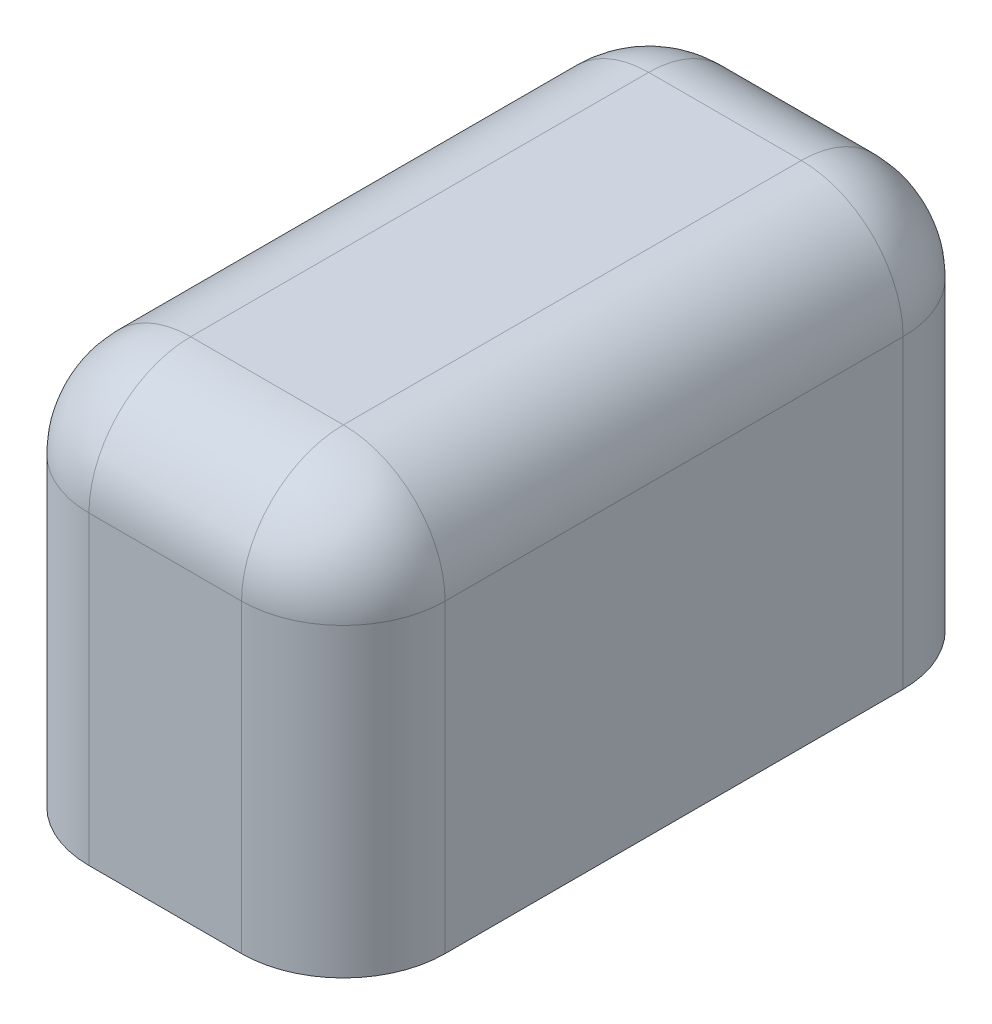
ISO-10303-21;
HEADER;
FILE_DESCRIPTION(('STEP AP214'),'2;1');
FILE_NAME('part.step','',(''),(''),'','','');
FILE_SCHEMA(('AUTOMOTIVE_DESIGN { 1 0 10303 214 1 1 1 1 }'));
ENDSEC;
DATA;
#1=APPLICATION_CONTEXT('core data for automotive mechanical design processes');
#2=APPLICATION_PROTOCOL_DEFINITION('international standard','automotive_design',2000,#1);
#3=PRODUCT_CONTEXT('',#1,'mechanical');
#4=PRODUCT('Part','Part','',(#3));
#5=PRODUCT_RELATED_PRODUCT_CATEGORY('part','',(#4));
#6=PRODUCT_DEFINITION_FORMATION('','',#4);
#7=PRODUCT_DEFINITION_CONTEXT('part definition',#1,'design');
#8=PRODUCT_DEFINITION('design','',#6,#7);
#9=PRODUCT_DEFINITION_SHAPE('','',#8);
#10=(LENGTH_UNIT() NAMED_UNIT(*) SI_UNIT(.MILLI.,.METRE.));
#11=(NAMED_UNIT(*) PLANE_ANGLE_UNIT() SI_UNIT($,.RADIAN.));
#12=(NAMED_UNIT(*) SI_UNIT($,.STERADIAN.) SOLID_ANGLE_UNIT());
#13=UNCERTAINTY_MEASURE_WITH_UNIT(LENGTH_MEASURE(1.E-05),#10,'distance_accuracy_value','');
#14=(GEOMETRIC_REPRESENTATION_CONTEXT(3) GLOBAL_UNCERTAINTY_ASSIGNED_CONTEXT((#13)) GLOBAL_UNIT_ASSIGNED_CONTEXT((#10,
#11,#12)) REPRESENTATION_CONTEXT('',''));
#15=CARTESIAN_POINT('',(0.,0.,0.));
#16=DIRECTION('',(0.,0.,1.));
#17=DIRECTION('',(1.,0.,0.));
#18=AXIS2_PLACEMENT_3D('',#15,#16,#17);
#19=CARTESIAN_POINT('',(4.445,0.,0.));
#20=DIRECTION('',(0.,0.,1.));
#21=DIRECTION('',(-1.,0.,0.));
#22=AXIS2_PLACEMENT_3D('',#19,#20,#21);
#23=PLANE('',#22);
#24=DIRECTION('',(-1.,0.,0.));
#25=VECTOR('',#24,1.);
#26=CARTESIAN_POINT('',(4.445,7.62,0.));
#27=LINE('',#26,#25);
#28=CARTESIAN_POINT('',(1.905,7.62,0.));
#29=VERTEX_POINT('',#28);
#30=CARTESIAN_POINT('',(-1.905,7.62,0.));
#31=VERTEX_POINT('',#30);
#32=EDGE_CURVE('E177',#29,#31,#27,.T.);
#33=ORIENTED_EDGE('',*,*,#32,.F.);
#34=DIRECTION('',(0.,-1.,0.));
#35=VECTOR('',#34,1.);
#36=CARTESIAN_POINT('',(1.905,0.,0.));
#37=LINE('',#36,#35);
#38=CARTESIAN_POINT('',(1.905,0.,0.));
#39=VERTEX_POINT('',#38);
#40=EDGE_CURVE('E175',#39,#29,#37,.F.);
#41=ORIENTED_EDGE('',*,*,#40,.F.);
#42=DIRECTION('',(-1.,0.,0.));
#43=VECTOR('',#42,1.);
#44=CARTESIAN_POINT('',(4.445,0.,0.));
#45=LINE('',#44,#43);
#46=CARTESIAN_POINT('',(-1.905,0.,0.));
#47=VERTEX_POINT('',#46);
#48=EDGE_CURVE('E150',#39,#47,#45,.T.);
#49=ORIENTED_EDGE('',*,*,#48,.T.);
#50=DIRECTION('',(0.,-1.,0.));
#51=VECTOR('',#50,1.);
#52=CARTESIAN_POINT('',(-1.905,0.,0.));
#53=LINE('',#52,#51);
#54=EDGE_CURVE('E179',#31,#47,#53,.T.);
#55=ORIENTED_EDGE('',*,*,#54,.F.);
#56=EDGE_LOOP('',(#33,#41,#49,#55));
#57=FACE_BOUND('',#56,.T.);
#58=ADVANCED_FACE('F41',(#57),#23,.F.);
#59=CARTESIAN_POINT('',(4.445,0.,0.));
#60=DIRECTION('',(0.,1.,0.));
#61=DIRECTION('',(0.,0.,-1.));
#62=AXIS2_PLACEMENT_3D('',#59,#60,#61);
#63=PLANE('',#62);
#64=DIRECTION('',(-1.,0.,0.));
#65=VECTOR('',#64,1.);
#66=CARTESIAN_POINT('',(4.445,0.,16.51));
#67=LINE('',#66,#65);
#68=CARTESIAN_POINT('',(1.905,0.,16.51));
#69=VERTEX_POINT('',#68);
#70=CARTESIAN_POINT('',(-1.905,0.,16.51));
#71=VERTEX_POINT('',#70);
#72=EDGE_CURVE('E153',#69,#71,#67,.T.);
#73=ORIENTED_EDGE('',*,*,#72,.T.);
#74=CARTESIAN_POINT('',(-1.905,0.,13.97));
#75=DIRECTION('',(0.,-1.,0.));
#76=DIRECTION('',(0.,0.,-1.));
#77=AXIS2_PLACEMENT_3D('',#74,#75,#76);
#78=CIRCLE('',#77,2.54);
#79=CARTESIAN_POINT('',(-4.445,0.,13.97));
#80=VERTEX_POINT('',#79);
#81=EDGE_CURVE('E50',#80,#71,#78,.F.);
#82=ORIENTED_EDGE('',*,*,#81,.F.);
#83=DIRECTION('',(0.,0.,1.));
#84=VECTOR('',#83,1.);
#85=CARTESIAN_POINT('',(-4.445,0.,0.));
#86=LINE('',#85,#84);
#87=CARTESIAN_POINT('',(-4.445,0.,2.54));
#88=VERTEX_POINT('',#87);
#89=EDGE_CURVE('E229',#88,#80,#86,.T.);
#90=ORIENTED_EDGE('',*,*,#89,.F.);
#91=CARTESIAN_POINT('',(-1.905,0.,2.54));
#92=DIRECTION('',(0.,-1.,0.));
#93=DIRECTION('',(0.,0.,-1.));
#94=AXIS2_PLACEMENT_3D('',#91,#92,#93);
#95=CIRCLE('',#94,2.54);
#96=EDGE_CURVE('E190',#47,#88,#95,.F.);
#97=ORIENTED_EDGE('',*,*,#96,.F.);
#98=ORIENTED_EDGE('',*,*,#48,.F.);
#99=CARTESIAN_POINT('',(1.905,0.,2.54));
#100=DIRECTION('',(0.,-1.,0.));
#101=DIRECTION('',(0.,0.,-1.));
#102=AXIS2_PLACEMENT_3D('',#99,#100,#101);
#103=CIRCLE('',#102,2.54);
#104=CARTESIAN_POINT('',(4.445,0.,2.54));
#105=VERTEX_POINT('',#104);
#106=EDGE_CURVE('E188',#105,#39,#103,.F.);
#107=ORIENTED_EDGE('',*,*,#106,.F.);
#108=DIRECTION('',(0.,0.,1.));
#109=VECTOR('',#108,1.);
#110=CARTESIAN_POINT('',(4.445,0.,0.));
#111=LINE('',#110,#109);
#112=CARTESIAN_POINT('',(4.445,0.,13.97));
#113=VERTEX_POINT('',#112);
#114=EDGE_CURVE('E232',#105,#113,#111,.T.);
#115=ORIENTED_EDGE('',*,*,#114,.T.);
#116=CARTESIAN_POINT('',(1.905,0.,13.97));
#117=DIRECTION('',(0.,-1.,0.));
#118=DIRECTION('',(0.,0.,-1.));
#119=AXIS2_PLACEMENT_3D('',#116,#117,#118);
#120=CIRCLE('',#119,2.54);
#121=EDGE_CURVE('E11',#69,#113,#120,.F.);
#122=ORIENTED_EDGE('',*,*,#121,.F.);
#123=EDGE_LOOP('',(#73,#82,#90,#97,#98,#107,#115,#122));
#124=FACE_BOUND('',#123,.T.);
#125=ADVANCED_FACE('F224',(#124),#63,.F.);
#126=CARTESIAN_POINT('',(4.445,0.,16.51));
#127=DIRECTION('',(0.,0.,-1.));
#128=DIRECTION('',(1.,0.,0.));
#129=AXIS2_PLACEMENT_3D('',#126,#127,#128);
#130=PLANE('',#129);
#131=DIRECTION('',(-1.,0.,0.));
#132=VECTOR('',#131,1.);
#133=CARTESIAN_POINT('',(4.445,7.62,16.51));
#134=LINE('',#133,#132);
#135=CARTESIAN_POINT('',(-1.905,7.62,16.51));
#136=VERTEX_POINT('',#135);
#137=CARTESIAN_POINT('',(1.905,7.62,16.51));
#138=VERTEX_POINT('',#137);
#139=EDGE_CURVE('E162',#136,#138,#134,.F.);
#140=ORIENTED_EDGE('',*,*,#139,.F.);
#141=DIRECTION('',(0.,1.,0.));
#142=VECTOR('',#141,1.);
#143=CARTESIAN_POINT('',(-1.905,10.16,16.51));
#144=LINE('',#143,#142);
#145=EDGE_CURVE('E159',#71,#136,#144,.T.);
#146=ORIENTED_EDGE('',*,*,#145,.F.);
#147=ORIENTED_EDGE('',*,*,#72,.F.);
#148=DIRECTION('',(0.,1.,0.));
#149=VECTOR('',#148,1.);
#150=CARTESIAN_POINT('',(1.905,0.,16.51));
#151=LINE('',#150,#149);
#152=EDGE_CURVE('E165',#138,#69,#151,.F.);
#153=ORIENTED_EDGE('',*,*,#152,.F.);
#154=EDGE_LOOP('',(#140,#146,#147,#153));
#155=FACE_BOUND('',#154,.T.);
#156=ADVANCED_FACE('F240',(#155),#130,.F.);
#157=CARTESIAN_POINT('',(4.445,10.16,0.));
#158=DIRECTION('',(0.,-1.,0.));
#159=DIRECTION('',(0.,0.,1.));
#160=AXIS2_PLACEMENT_3D('',#157,#158,#159);
#161=PLANE('',#160);
#162=DIRECTION('',(0.,0.,-1.));
#163=VECTOR('',#162,1.);
#164=CARTESIAN_POINT('',(1.905,10.16,0.));
#165=LINE('',#164,#163);
#166=CARTESIAN_POINT('',(1.905,10.16,2.54));
#167=VERTEX_POINT('',#166);
#168=CARTESIAN_POINT('',(1.905,10.16,13.97));
#169=VERTEX_POINT('',#168);
#170=EDGE_CURVE('E122',#167,#169,#165,.F.);
#171=ORIENTED_EDGE('',*,*,#170,.F.);
#172=DIRECTION('',(-1.,0.,0.));
#173=VECTOR('',#172,1.);
#174=CARTESIAN_POINT('',(4.445,10.16,2.54));
#175=LINE('',#174,#173);
#176=CARTESIAN_POINT('',(-1.905,10.16,2.54));
#177=VERTEX_POINT('',#176);
#178=EDGE_CURVE('E138',#177,#167,#175,.F.);
#179=ORIENTED_EDGE('',*,*,#178,.F.);
#180=DIRECTION('',(0.,0.,-1.));
#181=VECTOR('',#180,1.);
#182=CARTESIAN_POINT('',(-1.905,10.16,0.));
#183=LINE('',#182,#181);
#184=CARTESIAN_POINT('',(-1.905,10.16,13.97));
#185=VERTEX_POINT('',#184);
#186=EDGE_CURVE('E144',#185,#177,#183,.T.);
#187=ORIENTED_EDGE('',*,*,#186,.F.);
#188=DIRECTION('',(-1.,0.,0.));
#189=VECTOR('',#188,1.);
#190=CARTESIAN_POINT('',(4.445,10.16,13.97));
#191=LINE('',#190,#189);
#192=EDGE_CURVE('E149',#169,#185,#191,.T.);
#193=ORIENTED_EDGE('',*,*,#192,.F.);
#194=EDGE_LOOP('',(#171,#179,#187,#193));
#195=FACE_BOUND('',#194,.T.);
#196=ADVANCED_FACE('F147',(#195),#161,.F.);
#197=CARTESIAN_POINT('',(4.445,0.,0.));
#198=DIRECTION('',(-1.,0.,0.));
#199=DIRECTION('',(0.,0.,-1.));
#200=AXIS2_PLACEMENT_3D('',#197,#198,#199);
#201=PLANE('',#200);
#202=ORIENTED_EDGE('',*,*,#114,.F.);
#203=DIRECTION('',(0.,-1.,0.));
#204=VECTOR('',#203,1.);
#205=CARTESIAN_POINT('',(4.445,0.,2.54));
#206=LINE('',#205,#204);
#207=CARTESIAN_POINT('',(4.445,7.62,2.54));
#208=VERTEX_POINT('',#207);
#209=EDGE_CURVE('E182',#208,#105,#206,.T.);
#210=ORIENTED_EDGE('',*,*,#209,.F.);
#211=DIRECTION('',(0.,0.,-1.));
#212=VECTOR('',#211,1.);
#213=CARTESIAN_POINT('',(4.445,7.62,0.));
#214=LINE('',#213,#212);
#215=CARTESIAN_POINT('',(4.445,7.62,13.97));
#216=VERTEX_POINT('',#215);
#217=EDGE_CURVE('E124',#216,#208,#214,.T.);
#218=ORIENTED_EDGE('',*,*,#217,.F.);
#219=DIRECTION('',(0.,1.,0.));
#220=VECTOR('',#219,1.);
#221=CARTESIAN_POINT('',(4.445,0.,13.97));
#222=LINE('',#221,#220);
#223=EDGE_CURVE('E185',#113,#216,#222,.T.);
#224=ORIENTED_EDGE('',*,*,#223,.F.);
#225=EDGE_LOOP('',(#202,#210,#218,#224));
#226=FACE_BOUND('',#225,.T.);
#227=ADVANCED_FACE('F257',(#226),#201,.F.);
#228=CARTESIAN_POINT('',(-4.445,0.,0.));
#229=DIRECTION('',(-1.,0.,0.));
#230=DIRECTION('',(0.,0.,-1.));
#231=AXIS2_PLACEMENT_3D('',#228,#229,#230);
#232=PLANE('',#231);
#233=DIRECTION('',(0.,0.,-1.));
#234=VECTOR('',#233,1.);
#235=CARTESIAN_POINT('',(-4.445,7.62,16.51));
#236=LINE('',#235,#234);
#237=CARTESIAN_POINT('',(-4.445,7.62,2.54));
#238=VERTEX_POINT('',#237);
#239=CARTESIAN_POINT('',(-4.445,7.62,13.97));
#240=VERTEX_POINT('',#239);
#241=EDGE_CURVE('E170',#238,#240,#236,.F.);
#242=ORIENTED_EDGE('',*,*,#241,.F.);
#243=DIRECTION('',(0.,-1.,0.));
#244=VECTOR('',#243,1.);
#245=CARTESIAN_POINT('',(-4.445,10.16,2.54));
#246=LINE('',#245,#244);
#247=EDGE_CURVE('E167',#88,#238,#246,.F.);
#248=ORIENTED_EDGE('',*,*,#247,.F.);
#249=ORIENTED_EDGE('',*,*,#89,.T.);
#250=DIRECTION('',(0.,1.,0.));
#251=VECTOR('',#250,1.);
#252=CARTESIAN_POINT('',(-4.445,0.,13.97));
#253=LINE('',#252,#251);
#254=EDGE_CURVE('E173',#240,#80,#253,.F.);
#255=ORIENTED_EDGE('',*,*,#254,.F.);
#256=EDGE_LOOP('',(#242,#248,#249,#255));
#257=FACE_BOUND('',#256,.T.);
#258=ADVANCED_FACE('F245',(#257),#232,.T.);
#259=CARTESIAN_POINT('',(1.905,0.,2.54));
#260=DIRECTION('',(0.,-1.,0.));
#261=DIRECTION('',(0.,0.,1.));
#262=AXIS2_PLACEMENT_3D('',#259,#260,#261);
#263=CYLINDRICAL_SURFACE('',#262,2.54);
#264=ORIENTED_EDGE('',*,*,#106,.T.);
#265=ORIENTED_EDGE('',*,*,#40,.T.);
#266=CARTESIAN_POINT('',(1.905,7.62,2.54));
#267=DIRECTION('',(0.,-1.,0.));
#268=DIRECTION('',(0.,0.,-1.));
#269=AXIS2_PLACEMENT_3D('',#266,#267,#268);
#270=CIRCLE('',#269,2.54);
#271=EDGE_CURVE('E45',#29,#208,#270,.T.);
#272=ORIENTED_EDGE('',*,*,#271,.T.);
#273=ORIENTED_EDGE('',*,*,#209,.T.);
#274=EDGE_LOOP('',(#264,#265,#272,#273));
#275=FACE_BOUND('',#274,.T.);
#276=ADVANCED_FACE('F43',(#275),#263,.T.);
#277=CARTESIAN_POINT('',(4.445,7.62,2.54));
#278=DIRECTION('',(-1.,0.,0.));
#279=DIRECTION('',(0.,0.,-1.));
#280=AXIS2_PLACEMENT_3D('',#277,#278,#279);
#281=CYLINDRICAL_SURFACE('',#280,2.54);
#282=CARTESIAN_POINT('',(-1.905,7.62,2.54));
#283=DIRECTION('',(1.,0.,0.));
#284=DIRECTION('',(0.,0.,-1.));
#285=AXIS2_PLACEMENT_3D('',#282,#283,#284);
#286=CIRCLE('',#285,2.54);
#287=EDGE_CURVE('E135',#31,#177,#286,.T.);
#288=ORIENTED_EDGE('',*,*,#287,.T.);
#289=ORIENTED_EDGE('',*,*,#178,.T.);
#290=CARTESIAN_POINT('',(1.905,7.62,2.54));
#291=DIRECTION('',(-1.,0.,0.));
#292=DIRECTION('',(0.,0.,1.));
#293=AXIS2_PLACEMENT_3D('',#290,#291,#292);
#294=CIRCLE('',#293,2.54);
#295=EDGE_CURVE('E129',#167,#29,#294,.T.);
#296=ORIENTED_EDGE('',*,*,#295,.T.);
#297=ORIENTED_EDGE('',*,*,#32,.T.);
#298=EDGE_LOOP('',(#288,#289,#296,#297));
#299=FACE_BOUND('',#298,.T.);
#300=ADVANCED_FACE('F139',(#299),#281,.T.);
#301=CARTESIAN_POINT('',(-1.905,0.,2.54));
#302=DIRECTION('',(0.,1.,0.));
#303=DIRECTION('',(0.,0.,-1.));
#304=AXIS2_PLACEMENT_3D('',#301,#302,#303);
#305=CYLINDRICAL_SURFACE('',#304,2.54);
#306=ORIENTED_EDGE('',*,*,#96,.T.);
#307=ORIENTED_EDGE('',*,*,#247,.T.);
#308=CARTESIAN_POINT('',(-1.905,7.62,2.54));
#309=DIRECTION('',(0.,-1.,0.));
#310=DIRECTION('',(0.,0.,-1.));
#311=AXIS2_PLACEMENT_3D('',#308,#309,#310);
#312=CIRCLE('',#311,2.54);
#313=EDGE_CURVE('E126',#238,#31,#312,.T.);
#314=ORIENTED_EDGE('',*,*,#313,.T.);
#315=ORIENTED_EDGE('',*,*,#54,.T.);
#316=EDGE_LOOP('',(#306,#307,#314,#315));
#317=FACE_BOUND('',#316,.T.);
#318=ADVANCED_FACE('F212',(#317),#305,.T.);
#319=CARTESIAN_POINT('',(1.905,7.62,2.54));
#320=DIRECTION('',(0.,0.,-1.));
#321=DIRECTION('',(1.,0.,0.));
#322=AXIS2_PLACEMENT_3D('',#319,#320,#321);
#323=SPHERICAL_SURFACE('',#322,2.54);
#324=ORIENTED_EDGE('',*,*,#295,.F.);
#325=CARTESIAN_POINT('',(1.905,7.62,2.54));
#326=DIRECTION('',(0.,0.,1.));
#327=DIRECTION('',(1.,0.,0.));
#328=AXIS2_PLACEMENT_3D('',#325,#326,#327);
#329=CIRCLE('',#328,2.54);
#330=EDGE_CURVE('E66',#167,#208,#329,.F.);
#331=ORIENTED_EDGE('',*,*,#330,.T.);
#332=ORIENTED_EDGE('',*,*,#271,.F.);
#333=EDGE_LOOP('',(#324,#331,#332));
#334=FACE_BOUND('',#333,.T.);
#335=ADVANCED_FACE('F131',(#334),#323,.T.);
#336=CARTESIAN_POINT('',(-1.905,7.62,2.54));
#337=DIRECTION('',(0.,0.,-1.));
#338=DIRECTION('',(1.,0.,0.));
#339=AXIS2_PLACEMENT_3D('',#336,#337,#338);
#340=SPHERICAL_SURFACE('',#339,2.54);
#341=ORIENTED_EDGE('',*,*,#313,.F.);
#342=CARTESIAN_POINT('',(-1.905,7.62,2.54));
#343=DIRECTION('',(0.,0.,1.));
#344=DIRECTION('',(1.,0.,0.));
#345=AXIS2_PLACEMENT_3D('',#342,#343,#344);
#346=CIRCLE('',#345,2.54);
#347=EDGE_CURVE('E127',#238,#177,#346,.F.);
#348=ORIENTED_EDGE('',*,*,#347,.T.);
#349=ORIENTED_EDGE('',*,*,#287,.F.);
#350=EDGE_LOOP('',(#341,#348,#349));
#351=FACE_BOUND('',#350,.T.);
#352=ADVANCED_FACE('F216',(#351),#340,.T.);
#353=CARTESIAN_POINT('',(1.905,0.,13.97));
#354=DIRECTION('',(0.,1.,0.));
#355=DIRECTION('',(0.,0.,-1.));
#356=AXIS2_PLACEMENT_3D('',#353,#354,#355);
#357=CYLINDRICAL_SURFACE('',#356,2.54);
#358=ORIENTED_EDGE('',*,*,#121,.T.);
#359=ORIENTED_EDGE('',*,*,#223,.T.);
#360=CARTESIAN_POINT('',(1.905,7.62,13.97));
#361=DIRECTION('',(0.,-1.,0.));
#362=DIRECTION('',(0.,0.,-1.));
#363=AXIS2_PLACEMENT_3D('',#360,#361,#362);
#364=CIRCLE('',#363,2.54);
#365=EDGE_CURVE('E205',#216,#138,#364,.T.);
#366=ORIENTED_EDGE('',*,*,#365,.T.);
#367=ORIENTED_EDGE('',*,*,#152,.T.);
#368=EDGE_LOOP('',(#358,#359,#366,#367));
#369=FACE_BOUND('',#368,.T.);
#370=ADVANCED_FACE('F254',(#369),#357,.T.);
#371=CARTESIAN_POINT('',(1.905,7.62,0.));
#372=DIRECTION('',(0.,0.,-1.));
#373=DIRECTION('',(1.,0.,0.));
#374=AXIS2_PLACEMENT_3D('',#371,#372,#373);
#375=CYLINDRICAL_SURFACE('',#374,2.54);
#376=ORIENTED_EDGE('',*,*,#330,.F.);
#377=ORIENTED_EDGE('',*,*,#170,.T.);
#378=CARTESIAN_POINT('',(1.905,7.62,13.97));
#379=DIRECTION('',(0.,0.,-1.));
#380=DIRECTION('',(-1.,0.,0.));
#381=AXIS2_PLACEMENT_3D('',#378,#379,#380);
#382=CIRCLE('',#381,2.54);
#383=EDGE_CURVE('E58',#169,#216,#382,.T.);
#384=ORIENTED_EDGE('',*,*,#383,.T.);
#385=ORIENTED_EDGE('',*,*,#217,.T.);
#386=EDGE_LOOP('',(#376,#377,#384,#385));
#387=FACE_BOUND('',#386,.T.);
#388=ADVANCED_FACE('F120',(#387),#375,.T.);
#389=CARTESIAN_POINT('',(-1.905,7.62,0.));
#390=DIRECTION('',(0.,0.,1.));
#391=DIRECTION('',(-1.,0.,0.));
#392=AXIS2_PLACEMENT_3D('',#389,#390,#391);
#393=CYLINDRICAL_SURFACE('',#392,2.54);
#394=ORIENTED_EDGE('',*,*,#347,.F.);
#395=ORIENTED_EDGE('',*,*,#241,.T.);
#396=CARTESIAN_POINT('',(-1.905,7.62,13.97));
#397=DIRECTION('',(0.,0.,-1.));
#398=DIRECTION('',(-1.,0.,0.));
#399=AXIS2_PLACEMENT_3D('',#396,#397,#398);
#400=CIRCLE('',#399,2.54);
#401=EDGE_CURVE('E201',#240,#185,#400,.T.);
#402=ORIENTED_EDGE('',*,*,#401,.T.);
#403=ORIENTED_EDGE('',*,*,#186,.T.);
#404=EDGE_LOOP('',(#394,#395,#402,#403));
#405=FACE_BOUND('',#404,.T.);
#406=ADVANCED_FACE('F247',(#405),#393,.T.);
#407=CARTESIAN_POINT('',(-1.905,0.,13.97));
#408=DIRECTION('',(0.,-1.,0.));
#409=DIRECTION('',(0.,0.,1.));
#410=AXIS2_PLACEMENT_3D('',#407,#408,#409);
#411=CYLINDRICAL_SURFACE('',#410,2.54);
#412=ORIENTED_EDGE('',*,*,#81,.T.);
#413=ORIENTED_EDGE('',*,*,#145,.T.);
#414=CARTESIAN_POINT('',(-1.905,7.62,13.97));
#415=DIRECTION('',(0.,-1.,0.));
#416=DIRECTION('',(0.,0.,-1.));
#417=AXIS2_PLACEMENT_3D('',#414,#415,#416);
#418=CIRCLE('',#417,2.54);
#419=EDGE_CURVE('E199',#136,#240,#418,.T.);
#420=ORIENTED_EDGE('',*,*,#419,.T.);
#421=ORIENTED_EDGE('',*,*,#254,.T.);
#422=EDGE_LOOP('',(#412,#413,#420,#421));
#423=FACE_BOUND('',#422,.T.);
#424=ADVANCED_FACE('F242',(#423),#411,.T.);
#425=CARTESIAN_POINT('',(1.905,7.62,13.97));
#426=DIRECTION('',(1.,0.,0.));
#427=DIRECTION('',(0.,0.,1.));
#428=AXIS2_PLACEMENT_3D('',#425,#426,#427);
#429=SPHERICAL_SURFACE('',#428,2.54);
#430=ORIENTED_EDGE('',*,*,#383,.F.);
#431=CARTESIAN_POINT('',(1.905,7.62,13.97));
#432=DIRECTION('',(-1.,0.,0.));
#433=DIRECTION('',(0.,0.,1.));
#434=AXIS2_PLACEMENT_3D('',#431,#432,#433);
#435=CIRCLE('',#434,2.54);
#436=EDGE_CURVE('E197',#169,#138,#435,.F.);
#437=ORIENTED_EDGE('',*,*,#436,.T.);
#438=ORIENTED_EDGE('',*,*,#365,.F.);
#439=EDGE_LOOP('',(#430,#437,#438));
#440=FACE_BOUND('',#439,.T.);
#441=ADVANCED_FACE('F252',(#440),#429,.T.);
#442=CARTESIAN_POINT('',(-1.905,7.62,13.97));
#443=DIRECTION('',(-1.,0.,0.));
#444=DIRECTION('',(0.,0.,-1.));
#445=AXIS2_PLACEMENT_3D('',#442,#443,#444);
#446=SPHERICAL_SURFACE('',#445,2.54);
#447=ORIENTED_EDGE('',*,*,#419,.F.);
#448=CARTESIAN_POINT('',(-1.905,7.62,13.97));
#449=DIRECTION('',(1.,0.,0.));
#450=DIRECTION('',(0.,0.,-1.));
#451=AXIS2_PLACEMENT_3D('',#448,#449,#450);
#452=CIRCLE('',#451,2.54);
#453=EDGE_CURVE('E195',#136,#185,#452,.F.);
#454=ORIENTED_EDGE('',*,*,#453,.T.);
#455=ORIENTED_EDGE('',*,*,#401,.F.);
#456=EDGE_LOOP('',(#447,#454,#455));
#457=FACE_BOUND('',#456,.T.);
#458=ADVANCED_FACE('F275',(#457),#446,.T.);
#459=CARTESIAN_POINT('',(4.445,7.62,13.97));
#460=DIRECTION('',(-1.,0.,0.));
#461=DIRECTION('',(0.,0.,-1.));
#462=AXIS2_PLACEMENT_3D('',#459,#460,#461);
#463=CYLINDRICAL_SURFACE('',#462,2.54);
#464=ORIENTED_EDGE('',*,*,#436,.F.);
#465=ORIENTED_EDGE('',*,*,#192,.T.);
#466=ORIENTED_EDGE('',*,*,#453,.F.);
#467=ORIENTED_EDGE('',*,*,#139,.T.);
#468=EDGE_LOOP('',(#464,#465,#466,#467));
#469=FACE_BOUND('',#468,.T.);
#470=ADVANCED_FACE('F250',(#469),#463,.T.);
#471=CLOSED_SHELL('',(#58,#125,#156,#196,#227,#258,#276,#300,#318,#335,#352,#370,#388,#406,#424,
#441,#458,#470));
#472=MANIFOLD_SOLID_BREP('B2',#471);
#473=ADVANCED_BREP_SHAPE_REPRESENTATION('',(#18,#472),#14);
#474=SHAPE_DEFINITION_REPRESENTATION(#9,#473);
ENDSEC;
END-ISO-10303-21;
